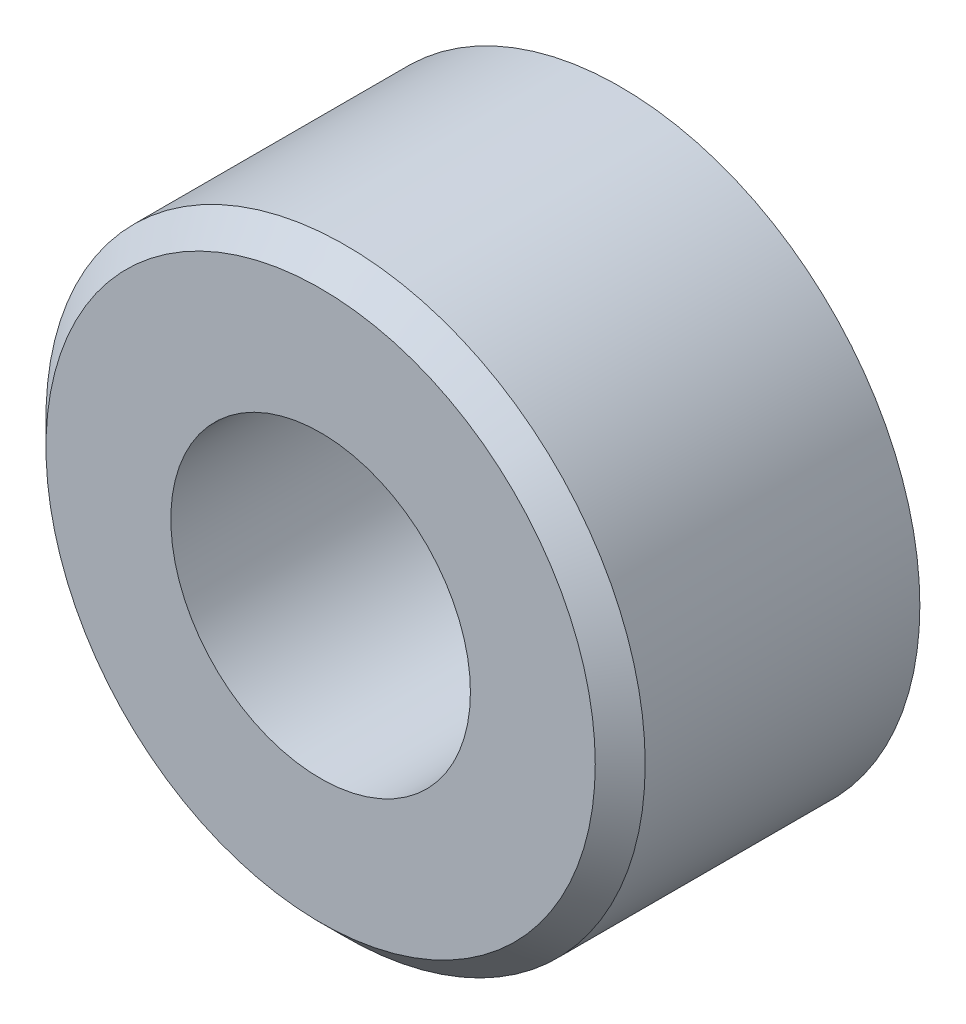
ISO-10303-21;
HEADER;
FILE_DESCRIPTION(('STEP AP214'),'2;1');
FILE_NAME('part.step','',(''),(''),'','','');
FILE_SCHEMA(('AUTOMOTIVE_DESIGN { 1 0 10303 214 1 1 1 1 }'));
ENDSEC;
DATA;
#1=APPLICATION_CONTEXT('core data for automotive mechanical design processes');
#2=APPLICATION_PROTOCOL_DEFINITION('international standard','automotive_design',2000,#1);
#3=PRODUCT_CONTEXT('',#1,'mechanical');
#4=PRODUCT('Part','Part','',(#3));
#5=PRODUCT_RELATED_PRODUCT_CATEGORY('part','',(#4));
#6=PRODUCT_DEFINITION_FORMATION('','',#4);
#7=PRODUCT_DEFINITION_CONTEXT('part definition',#1,'design');
#8=PRODUCT_DEFINITION('design','',#6,#7);
#9=PRODUCT_DEFINITION_SHAPE('','',#8);
#10=(LENGTH_UNIT() NAMED_UNIT(*) SI_UNIT(.MILLI.,.METRE.));
#11=(NAMED_UNIT(*) PLANE_ANGLE_UNIT() SI_UNIT($,.RADIAN.));
#12=(NAMED_UNIT(*) SI_UNIT($,.STERADIAN.) SOLID_ANGLE_UNIT());
#13=UNCERTAINTY_MEASURE_WITH_UNIT(LENGTH_MEASURE(1.E-05),#10,'distance_accuracy_value','');
#14=(GEOMETRIC_REPRESENTATION_CONTEXT(3) GLOBAL_UNCERTAINTY_ASSIGNED_CONTEXT((#13)) GLOBAL_UNIT_ASSIGNED_CONTEXT((#10,
#11,#12)) REPRESENTATION_CONTEXT('',''));
#15=CARTESIAN_POINT('',(0.,0.,0.));
#16=DIRECTION('',(0.,0.,1.));
#17=DIRECTION('',(1.,0.,0.));
#18=AXIS2_PLACEMENT_3D('',#15,#16,#17);
#19=CARTESIAN_POINT('',(0.,0.,6.));
#20=DIRECTION('',(0.,0.,1.));
#21=DIRECTION('',(1.,0.,0.));
#22=AXIS2_PLACEMENT_3D('',#19,#20,#21);
#23=PLANE('',#22);
#24=CARTESIAN_POINT('',(0.,0.,6.));
#25=DIRECTION('',(0.,0.,1.));
#26=DIRECTION('',(1.,0.,0.));
#27=AXIS2_PLACEMENT_3D('',#24,#25,#26);
#28=CIRCLE('',#27,5.5);
#29=CARTESIAN_POINT('',(5.5,0.,6.));
#30=VERTEX_POINT('',#29);
#31=EDGE_CURVE('E41',#30,#30,#28,.T.);
#32=ORIENTED_EDGE('',*,*,#31,.T.);
#33=EDGE_LOOP('',(#32));
#34=FACE_BOUND('',#33,.T.);
#35=CARTESIAN_POINT('',(0.,0.,6.));
#36=DIRECTION('',(0.,0.,1.));
#37=DIRECTION('',(1.,0.,0.));
#38=AXIS2_PLACEMENT_3D('',#35,#36,#37);
#39=CIRCLE('',#38,3.);
#40=CARTESIAN_POINT('',(3.,0.,6.));
#41=VERTEX_POINT('',#40);
#42=EDGE_CURVE('E49',#41,#41,#39,.T.);
#43=ORIENTED_EDGE('',*,*,#42,.F.);
#44=EDGE_LOOP('',(#43));
#45=FACE_BOUND('',#44,.T.);
#46=ADVANCED_FACE('F34',(#34,#45),#23,.T.);
#47=CARTESIAN_POINT('',(0.,0.,0.));
#48=DIRECTION('',(0.,0.,1.));
#49=DIRECTION('',(1.,0.,0.));
#50=AXIS2_PLACEMENT_3D('',#47,#48,#49);
#51=PLANE('',#50);
#52=CARTESIAN_POINT('',(0.,0.,0.));
#53=DIRECTION('',(0.,0.,1.));
#54=DIRECTION('',(1.,0.,0.));
#55=AXIS2_PLACEMENT_3D('',#52,#53,#54);
#56=CIRCLE('',#55,6.);
#57=CARTESIAN_POINT('',(6.,0.,0.));
#58=VERTEX_POINT('',#57);
#59=EDGE_CURVE('E45',#58,#58,#56,.T.);
#60=ORIENTED_EDGE('',*,*,#59,.F.);
#61=EDGE_LOOP('',(#60));
#62=FACE_BOUND('',#61,.T.);
#63=CARTESIAN_POINT('',(0.,0.,0.));
#64=DIRECTION('',(0.,0.,1.));
#65=DIRECTION('',(1.,0.,0.));
#66=AXIS2_PLACEMENT_3D('',#63,#64,#65);
#67=CIRCLE('',#66,3.);
#68=CARTESIAN_POINT('',(3.,0.,0.));
#69=VERTEX_POINT('',#68);
#70=EDGE_CURVE('E52',#69,#69,#67,.T.);
#71=ORIENTED_EDGE('',*,*,#70,.T.);
#72=EDGE_LOOP('',(#71));
#73=FACE_BOUND('',#72,.T.);
#74=ADVANCED_FACE('F62',(#62,#73),#51,.F.);
#75=CARTESIAN_POINT('',(0.,0.,6.));
#76=DIRECTION('',(0.,0.,-1.));
#77=DIRECTION('',(-1.,0.,0.));
#78=AXIS2_PLACEMENT_3D('',#75,#76,#77);
#79=CYLINDRICAL_SURFACE('',#78,6.);
#80=CARTESIAN_POINT('',(0.,0.,5.49999999999999));
#81=DIRECTION('',(0.,0.,1.));
#82=DIRECTION('',(1.,0.,0.));
#83=AXIS2_PLACEMENT_3D('',#80,#81,#82);
#84=CIRCLE('',#83,6.);
#85=CARTESIAN_POINT('',(6.,0.,5.49999999999999));
#86=VERTEX_POINT('',#85);
#87=EDGE_CURVE('E10',#86,#86,#84,.F.);
#88=ORIENTED_EDGE('',*,*,#87,.T.);
#89=EDGE_LOOP('',(#88));
#90=FACE_BOUND('',#89,.T.);
#91=ORIENTED_EDGE('',*,*,#59,.T.);
#92=EDGE_LOOP('',(#91));
#93=FACE_BOUND('',#92,.T.);
#94=ADVANCED_FACE('F67',(#90,#93),#79,.T.);
#95=CARTESIAN_POINT('',(0.,0.,6.));
#96=DIRECTION('',(0.,0.,-1.));
#97=DIRECTION('',(-1.,0.,0.));
#98=AXIS2_PLACEMENT_3D('',#95,#96,#97);
#99=CYLINDRICAL_SURFACE('',#98,3.);
#100=ORIENTED_EDGE('',*,*,#42,.T.);
#101=EDGE_LOOP('',(#100));
#102=FACE_BOUND('',#101,.T.);
#103=ORIENTED_EDGE('',*,*,#70,.F.);
#104=EDGE_LOOP('',(#103));
#105=FACE_BOUND('',#104,.T.);
#106=ADVANCED_FACE('F58',(#102,#105),#99,.F.);
#107=CARTESIAN_POINT('',(0.,0.,6.));
#108=DIRECTION('',(0.,0.,-1.));
#109=DIRECTION('',(-1.,0.,0.));
#110=AXIS2_PLACEMENT_3D('',#107,#108,#109);
#111=CONICAL_SURFACE('',#110,5.5,0.785398163397447);
#112=ORIENTED_EDGE('',*,*,#87,.F.);
#113=EDGE_LOOP('',(#112));
#114=FACE_BOUND('',#113,.T.);
#115=ORIENTED_EDGE('',*,*,#31,.F.);
#116=EDGE_LOOP('',(#115));
#117=FACE_BOUND('',#116,.T.);
#118=ADVANCED_FACE('F36',(#114,#117),#111,.T.);
#119=CLOSED_SHELL('',(#46,#74,#94,#106,#118));
#120=MANIFOLD_SOLID_BREP('B2',#119);
#121=ADVANCED_BREP_SHAPE_REPRESENTATION('',(#18,#120),#14);
#122=SHAPE_DEFINITION_REPRESENTATION(#9,#121);
ENDSEC;
END-ISO-10303-21;
